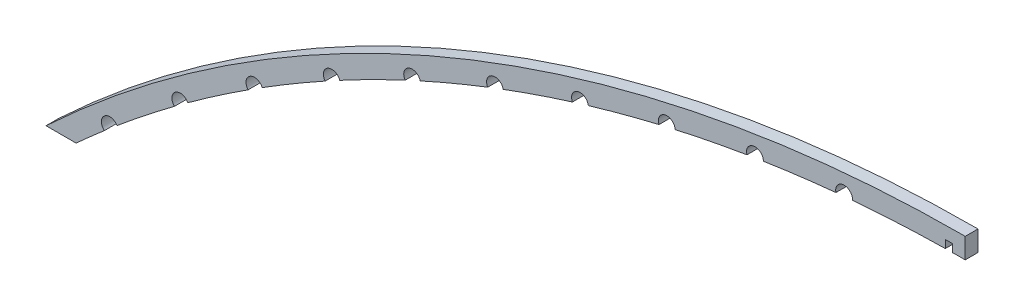
ISO-10303-21;
HEADER;
FILE_DESCRIPTION(('STEP AP214'),'2;1');
FILE_NAME('part.step','',(''),(''),'','','');
FILE_SCHEMA(('AUTOMOTIVE_DESIGN { 1 0 10303 214 1 1 1 1 }'));
ENDSEC;
DATA;
#1=APPLICATION_CONTEXT('core data for automotive mechanical design processes');
#2=APPLICATION_PROTOCOL_DEFINITION('international standard','automotive_design',2000,#1);
#3=PRODUCT_CONTEXT('',#1,'mechanical');
#4=PRODUCT('Part','Part','',(#3));
#5=PRODUCT_RELATED_PRODUCT_CATEGORY('part','',(#4));
#6=PRODUCT_DEFINITION_FORMATION('','',#4);
#7=PRODUCT_DEFINITION_CONTEXT('part definition',#1,'design');
#8=PRODUCT_DEFINITION('design','',#6,#7);
#9=PRODUCT_DEFINITION_SHAPE('','',#8);
#10=(LENGTH_UNIT() NAMED_UNIT(*) SI_UNIT(.MILLI.,.METRE.));
#11=(NAMED_UNIT(*) PLANE_ANGLE_UNIT() SI_UNIT($,.RADIAN.));
#12=(NAMED_UNIT(*) SI_UNIT($,.STERADIAN.) SOLID_ANGLE_UNIT());
#13=UNCERTAINTY_MEASURE_WITH_UNIT(LENGTH_MEASURE(1.E-05),#10,'distance_accuracy_value','');
#14=(GEOMETRIC_REPRESENTATION_CONTEXT(3) GLOBAL_UNCERTAINTY_ASSIGNED_CONTEXT((#13)) GLOBAL_UNIT_ASSIGNED_CONTEXT((#10,
#11,#12)) REPRESENTATION_CONTEXT('',''));
#15=CARTESIAN_POINT('',(0.,0.,0.));
#16=DIRECTION('',(0.,0.,1.));
#17=DIRECTION('',(1.,0.,0.));
#18=AXIS2_PLACEMENT_3D('',#15,#16,#17);
#19=CARTESIAN_POINT('',(228.6,-243.514144736841,310.522595060468));
#20=DIRECTION('',(0.,0.,-1.));
#21=DIRECTION('',(-1.,0.,0.));
#22=AXIS2_PLACEMENT_3D('',#19,#20,#21);
#23=CYLINDRICAL_SURFACE('',#22,328.921644736841);
#24=DIRECTION('',(0.,0.,-1.));
#25=VECTOR('',#24,1.);
#26=CARTESIAN_POINT('',(225.425,85.3921758947161,310.522595060468));
#27=LINE('',#26,#25);
#28=CARTESIAN_POINT('',(225.425,85.3921758947162,0.));
#29=VERTEX_POINT('',#28);
#30=CARTESIAN_POINT('',(225.425,85.3921758947162,3.17499999999998));
#31=VERTEX_POINT('',#30);
#32=EDGE_CURVE('E11',#29,#31,#27,.F.);
#33=ORIENTED_EDGE('',*,*,#32,.F.);
#34=CARTESIAN_POINT('',(228.6,-243.514144736841,0.));
#35=DIRECTION('',(0.,0.,-1.));
#36=DIRECTION('',(-1.,0.,0.));
#37=AXIS2_PLACEMENT_3D('',#34,#35,#36);
#38=CIRCLE('',#37,328.921644736841);
#39=CARTESIAN_POINT('',(228.6,85.4075000000001,0.));
#40=VERTEX_POINT('',#39);
#41=EDGE_CURVE('E238',#40,#29,#38,.F.);
#42=ORIENTED_EDGE('',*,*,#41,.F.);
#43=DIRECTION('',(0.,0.,-1.));
#44=VECTOR('',#43,1.);
#45=CARTESIAN_POINT('',(228.6,85.4075000000001,310.522595060468));
#46=LINE('',#45,#44);
#47=CARTESIAN_POINT('',(228.6,85.4075000000001,3.175));
#48=VERTEX_POINT('',#47);
#49=EDGE_CURVE('E254',#48,#40,#46,.T.);
#50=ORIENTED_EDGE('',*,*,#49,.F.);
#51=CARTESIAN_POINT('',(228.6,-243.514144736841,3.17499999999998));
#52=DIRECTION('',(0.,0.,-1.));
#53=DIRECTION('',(-1.,0.,0.));
#54=AXIS2_PLACEMENT_3D('',#51,#52,#53);
#55=CIRCLE('',#54,328.921644736841);
#56=EDGE_CURVE('E259',#48,#31,#55,.F.);
#57=ORIENTED_EDGE('',*,*,#56,.T.);
#58=EDGE_LOOP('',(#33,#42,#50,#57));
#59=FACE_BOUND('',#58,.T.);
#60=ADVANCED_FACE('F31',(#59),#23,.F.);
#61=CARTESIAN_POINT('',(14.5042082916886,6.19056156478265,3.175));
#62=VERTEX_POINT('',#61);
#63=CARTESIAN_POINT('',(7.48846776010612,0.,3.175));
#64=VERTEX_POINT('',#63);
#65=EDGE_CURVE('E251',#62,#64,#55,.F.);
#66=ORIENTED_EDGE('',*,*,#65,.T.);
#67=DIRECTION('',(0.,0.,-1.));
#68=VECTOR('',#67,1.);
#69=CARTESIAN_POINT('',(7.48846776010612,0.,310.522595060468));
#70=LINE('',#69,#68);
#71=CARTESIAN_POINT('',(7.48846776010612,0.,0.));
#72=VERTEX_POINT('',#71);
#73=EDGE_CURVE('E54',#64,#72,#70,.T.);
#74=ORIENTED_EDGE('',*,*,#73,.T.);
#75=CARTESIAN_POINT('',(14.5042082916886,6.19056156478265,0.));
#76=VERTEX_POINT('',#75);
#77=EDGE_CURVE('E241',#76,#72,#38,.F.);
#78=ORIENTED_EDGE('',*,*,#77,.F.);
#79=DIRECTION('',(0.,0.,-1.));
#80=VECTOR('',#79,1.);
#81=CARTESIAN_POINT('',(14.5042082916886,6.19056156478265,3.17500000000009));
#82=LINE('',#81,#80);
#83=EDGE_CURVE('E252',#76,#62,#82,.F.);
#84=ORIENTED_EDGE('',*,*,#83,.T.);
#85=EDGE_LOOP('',(#66,#74,#78,#84));
#86=FACE_BOUND('',#85,.T.);
#87=ADVANCED_FACE('F480',(#86),#23,.F.);
#88=CARTESIAN_POINT('',(228.6,-243.514144736841,3.175));
#89=DIRECTION('',(0.,0.,-1.));
#90=DIRECTION('',(-1.,0.,0.));
#91=AXIS2_PLACEMENT_3D('',#88,#89,#90);
#92=PLANE('',#91);
#93=CARTESIAN_POINT('',(223.647,85.3702060118511,3.17499999999998));
#94=VERTEX_POINT('',#93);
#95=CARTESIAN_POINT('',(200.570962712791,84.2110777364086,3.175));
#96=VERTEX_POINT('',#95);
#97=EDGE_CURVE('E244',#94,#96,#55,.F.);
#98=ORIENTED_EDGE('',*,*,#97,.F.);
#99=DIRECTION('',(0.,-1.,0.));
#100=VECTOR('',#99,1.);
#101=CARTESIAN_POINT('',(223.647,85.370206011851,3.175));
#102=LINE('',#101,#100);
#103=CARTESIAN_POINT('',(223.647,87.331989447736,3.175));
#104=VERTEX_POINT('',#103);
#105=EDGE_CURVE('E46',#104,#94,#102,.T.);
#106=ORIENTED_EDGE('',*,*,#105,.F.);
#107=DIRECTION('',(-1.,0.,0.));
#108=VECTOR('',#107,1.);
#109=CARTESIAN_POINT('',(223.647,87.331989447736,3.175));
#110=LINE('',#109,#108);
#111=CARTESIAN_POINT('',(225.425,87.331989447736,3.175));
#112=VERTEX_POINT('',#111);
#113=EDGE_CURVE('E233',#112,#104,#110,.T.);
#114=ORIENTED_EDGE('',*,*,#113,.F.);
#115=DIRECTION('',(0.,1.,0.));
#116=VECTOR('',#115,1.);
#117=CARTESIAN_POINT('',(225.425,85.370206011851,3.175));
#118=LINE('',#117,#116);
#119=EDGE_CURVE('E271',#31,#112,#118,.T.);
#120=ORIENTED_EDGE('',*,*,#119,.F.);
#121=ORIENTED_EDGE('',*,*,#56,.F.);
#122=DIRECTION('',(0.,1.,0.));
#123=VECTOR('',#122,1.);
#124=CARTESIAN_POINT('',(228.6,90.4875,3.175));
#125=LINE('',#124,#123);
#126=CARTESIAN_POINT('',(228.6,90.4875,3.175));
#127=VERTEX_POINT('',#126);
#128=EDGE_CURVE('E425',#48,#127,#125,.T.);
#129=ORIENTED_EDGE('',*,*,#128,.T.);
#130=CARTESIAN_POINT('',(228.6,-243.514144736841,3.175));
#131=DIRECTION('',(0.,0.,1.));
#132=DIRECTION('',(-1.,0.,0.));
#133=AXIS2_PLACEMENT_3D('',#130,#131,#132);
#134=CIRCLE('',#133,334.001644736841);
#135=CARTESIAN_POINT('',(0.,0.,3.175));
#136=VERTEX_POINT('',#135);
#137=EDGE_CURVE('E419',#127,#136,#134,.T.);
#138=ORIENTED_EDGE('',*,*,#137,.T.);
#139=DIRECTION('',(1.,0.,0.));
#140=VECTOR('',#139,1.);
#141=CARTESIAN_POINT('',(0.,0.,3.175));
#142=LINE('',#141,#140);
#143=EDGE_CURVE('E422',#136,#64,#142,.T.);
#144=ORIENTED_EDGE('',*,*,#143,.T.);
#145=ORIENTED_EDGE('',*,*,#65,.F.);
#146=CARTESIAN_POINT('',(15.875,7.77550646679812,3.175));
#147=DIRECTION('',(0.,0.,1.));
#148=DIRECTION('',(1.,0.,0.));
#149=AXIS2_PLACEMENT_3D('',#146,#147,#148);
#150=CIRCLE('',#149,2.0955);
#151=CARTESIAN_POINT('',(17.6644915981692,8.86584589563754,3.175));
#152=VERTEX_POINT('',#151);
#153=EDGE_CURVE('E412',#152,#62,#150,.T.);
#154=ORIENTED_EDGE('',*,*,#153,.F.);
#155=CARTESIAN_POINT('',(31.9326004568024,20.1359687342232,3.175));
#156=VERTEX_POINT('',#155);
#157=EDGE_CURVE('E348',#156,#152,#55,.F.);
#158=ORIENTED_EDGE('',*,*,#157,.F.);
#159=CARTESIAN_POINT('',(33.4077296853764,21.624294642419,3.175));
#160=DIRECTION('',(0.,0.,1.));
#161=DIRECTION('',(0.997697449972898,-0.0678218129924095,0.));
#162=AXIS2_PLACEMENT_3D('',#159,#160,#161);
#163=CIRCLE('',#162,2.0955);
#164=CARTESIAN_POINT('',(35.2670496864587,22.5907569456544,3.175));
#165=VERTEX_POINT('',#164);
#166=EDGE_CURVE('E407',#165,#156,#163,.T.);
#167=ORIENTED_EDGE('',*,*,#166,.F.);
#168=CARTESIAN_POINT('',(50.2666656742128,32.8672407518271,3.175));
#169=VERTEX_POINT('',#168);
#170=EDGE_CURVE('E338',#169,#165,#55,.F.);
#171=ORIENTED_EDGE('',*,*,#170,.F.);
#172=CARTESIAN_POINT('',(51.839339305359,34.2520937764826,3.175));
#173=DIRECTION('',(0.,0.,1.));
#174=DIRECTION('',(0.990800403364845,-0.135331299750131,0.));
#175=AXIS2_PLACEMENT_3D('',#172,#173,#174);
#176=CIRCLE('',#175,2.0955);
#177=CARTESIAN_POINT('',(53.7599253547167,35.0902282985091,3.175));
#178=VERTEX_POINT('',#177);
#179=EDGE_CURVE('E402',#178,#169,#176,.T.);
#180=ORIENTED_EDGE('',*,*,#179,.F.);
#181=CARTESIAN_POINT('',(69.4219737391934,44.325748836136,3.175));
#182=VERTEX_POINT('',#181);
#183=EDGE_CURVE('E328',#182,#178,#55,.F.);
#184=ORIENTED_EDGE('',*,*,#183,.F.);
#185=CARTESIAN_POINT('',(71.0849494534877,45.6007515905124,3.175));
#186=DIRECTION('',(0.,0.,1.));
#187=DIRECTION('',(0.979340621765552,-0.202217572332038,0.));
#188=AXIS2_PLACEMENT_3D('',#185,#186,#187);
#189=CIRCLE('',#188,2.0955);
#190=CARTESIAN_POINT('',(73.0579570602008,46.3066986379971,3.175));
#191=VERTEX_POINT('',#190);
#192=EDGE_CURVE('E397',#191,#182,#189,.T.);
#193=ORIENTED_EDGE('',*,*,#192,.F.);
#194=CARTESIAN_POINT('',(89.3103125415358,54.4587254109496,3.175));
#195=VERTEX_POINT('',#194);
#196=EDGE_CURVE('E318',#195,#191,#55,.F.);
#197=ORIENTED_EDGE('',*,*,#196,.F.);
#198=CARTESIAN_POINT('',(91.0559321694262,55.6180063797936,3.175));
#199=DIRECTION('',(0.,0.,1.));
#200=DIRECTION('',(0.96337087861588,-0.268172612760638,0.));
#201=AXIS2_PLACEMENT_3D('',#198,#199,#200);
#202=CIRCLE('',#201,2.0955);
#203=CARTESIAN_POINT('',(93.0722754360581,56.1885149959499,3.175));
#204=VERTEX_POINT('',#203);
#205=EDGE_CURVE('E392',#204,#195,#202,.T.);
#206=ORIENTED_EDGE('',*,*,#205,.F.);
#207=CARTESIAN_POINT('',(109.840094291143,63.2195071052942,3.175));
#208=VERTEX_POINT('',#207);
#209=EDGE_CURVE('E308',#208,#204,#55,.F.);
#210=ORIENTED_EDGE('',*,*,#209,.F.);
#211=CARTESIAN_POINT('',(111.660319079587,64.2577276837532,3.175));
#212=DIRECTION('',(0.,0.,1.));
#213=DIRECTION('',(0.942964716180876,-0.332892691475677,0.));
#214=AXIS2_PLACEMENT_3D('',#211,#212,#213);
#215=CIRCLE('',#214,2.0955);
#216=CARTESIAN_POINT('',(113.710712543651,64.690170619322,3.175));
#217=VERTEX_POINT('',#216);
#218=EDGE_CURVE('E387',#217,#208,#215,.T.);
#219=ORIENTED_EDGE('',*,*,#218,.F.);
#220=CARTESIAN_POINT('',(130.916777288968,70.5677496429142,3.175));
#221=VERTEX_POINT('',#220);
#222=EDGE_CURVE('E298',#221,#217,#55,.F.);
#223=ORIENTED_EDGE('',*,*,#222,.F.);
#224=CARTESIAN_POINT('',(132.803224920693,71.4801287213462,3.175));
#225=DIRECTION('',(0.,0.,1.));
#226=DIRECTION('',(0.918216106880274,-0.396079766039158,0.));
#227=AXIS2_PLACEMENT_3D('',#224,#225,#226);
#228=CIRCLE('',#227,2.0955);
#229=CARTESIAN_POINT('',(134.878226315137,71.7725145333413,3.175));
#230=VERTEX_POINT('',#229);
#231=EDGE_CURVE('E382',#230,#221,#228,.T.);
#232=ORIENTED_EDGE('',*,*,#231,.F.);
#233=CARTESIAN_POINT('',(152.443301300994,76.4696136317012,3.175));
#234=VERTEX_POINT('',#233);
#235=EDGE_CURVE('E289',#234,#230,#55,.F.);
#236=ORIENTED_EDGE('',*,*,#235,.F.);
#237=CARTESIAN_POINT('',(154.387284495909,77.2519496131627,3.175));
#238=DIRECTION('',(0.,0.,1.));
#239=DIRECTION('',(0.889239020536106,-0.457442853650582,0.));
#240=AXIS2_PLACEMENT_3D('',#237,#238,#239);
#241=CIRCLE('',#240,2.0955);
#242=CARTESIAN_POINT('',(156.477338231699,77.4029318356654,3.175));
#243=VERTEX_POINT('',#242);
#244=EDGE_CURVE('E377',#243,#234,#241,.T.);
#245=ORIENTED_EDGE('',*,*,#244,.F.);
#246=CARTESIAN_POINT('',(174.320534530327,80.8979203974807,3.175));
#247=VERTEX_POINT('',#246);
#248=EDGE_CURVE('E284',#247,#243,#55,.F.);
#249=ORIENTED_EDGE('',*,*,#248,.F.);
#250=CARTESIAN_POINT('',(176.313101051316,81.5466105465008,3.175));
#251=DIRECTION('',(0.,0.,1.));
#252=DIRECTION('',(0.856166899530266,-0.516699371151864,0.));
#253=AXIS2_PLACEMENT_3D('',#250,#251,#252);
#254=CIRCLE('',#253,2.0955);
#255=CARTESIAN_POINT('',(178.408582221879,81.5554938912703,3.175));
#256=VERTEX_POINT('',#255);
#257=EDGE_CURVE('E373',#256,#247,#254,.T.);
#258=ORIENTED_EDGE('',*,*,#257,.F.);
#259=CARTESIAN_POINT('',(196.447730129037,83.8322771445254,3.175));
#260=VERTEX_POINT('',#259);
#261=EDGE_CURVE('E247',#260,#256,#55,.F.);
#262=ORIENTED_EDGE('',*,*,#261,.F.);
#263=CARTESIAN_POINT('',(198.479704007906,84.344334178064,3.175));
#264=DIRECTION('',(0.,0.,1.));
#265=DIRECTION('',(0.819152044288991,-0.573576436351047,0.));
#266=AXIS2_PLACEMENT_3D('',#263,#264,#265);
#267=CIRCLE('',#266,2.0955);
#268=EDGE_CURVE('E366',#96,#260,#267,.T.);
#269=ORIENTED_EDGE('',*,*,#268,.F.);
#270=EDGE_LOOP('',(#98,#106,#114,#120,#121,#129,#138,#144,#145,#154,#158,#167,#171,#180,#184,
#193,#197,#206,#210,#219,#223,#232,#236,#245,#249,#258,#262,#269));
#271=FACE_BOUND('',#270,.T.);
#272=ADVANCED_FACE('F447',(#271),#92,.F.);
#273=CARTESIAN_POINT('',(228.6,-243.514144736841,0.));
#274=DIRECTION('',(0.,0.,-1.));
#275=DIRECTION('',(-1.,0.,0.));
#276=AXIS2_PLACEMENT_3D('',#273,#274,#275);
#277=PLANE('',#276);
#278=DIRECTION('',(0.,-1.,0.));
#279=VECTOR('',#278,1.);
#280=CARTESIAN_POINT('',(223.647,85.370206011851,0.));
#281=LINE('',#280,#279);
#282=CARTESIAN_POINT('',(223.647,87.331989447736,0.));
#283=VERTEX_POINT('',#282);
#284=CARTESIAN_POINT('',(223.647,85.370206011851,0.));
#285=VERTEX_POINT('',#284);
#286=EDGE_CURVE('E217',#283,#285,#281,.T.);
#287=ORIENTED_EDGE('',*,*,#286,.T.);
#288=CARTESIAN_POINT('',(200.570962712791,84.2110777364086,0.));
#289=VERTEX_POINT('',#288);
#290=EDGE_CURVE('E228',#285,#289,#38,.F.);
#291=ORIENTED_EDGE('',*,*,#290,.T.);
#292=CARTESIAN_POINT('',(198.479704007906,84.344334178064,0.));
#293=DIRECTION('',(0.,0.,1.));
#294=DIRECTION('',(0.819152044288991,-0.573576436351047,0.));
#295=AXIS2_PLACEMENT_3D('',#292,#293,#294);
#296=CIRCLE('',#295,2.0955);
#297=CARTESIAN_POINT('',(196.447730129037,83.8322771445254,0.));
#298=VERTEX_POINT('',#297);
#299=EDGE_CURVE('E369',#289,#298,#296,.T.);
#300=ORIENTED_EDGE('',*,*,#299,.T.);
#301=CARTESIAN_POINT('',(178.408582221879,81.5554938912703,0.));
#302=VERTEX_POINT('',#301);
#303=EDGE_CURVE('E242',#298,#302,#38,.F.);
#304=ORIENTED_EDGE('',*,*,#303,.T.);
#305=CARTESIAN_POINT('',(176.313101051316,81.5466105465008,0.));
#306=DIRECTION('',(0.,0.,1.));
#307=DIRECTION('',(0.856166899530266,-0.516699371151864,0.));
#308=AXIS2_PLACEMENT_3D('',#305,#306,#307);
#309=CIRCLE('',#308,2.0955);
#310=CARTESIAN_POINT('',(174.320534530327,80.8979203974807,0.));
#311=VERTEX_POINT('',#310);
#312=EDGE_CURVE('E375',#302,#311,#309,.T.);
#313=ORIENTED_EDGE('',*,*,#312,.T.);
#314=CARTESIAN_POINT('',(156.477338231699,77.4029318356654,0.));
#315=VERTEX_POINT('',#314);
#316=EDGE_CURVE('E245',#311,#315,#38,.F.);
#317=ORIENTED_EDGE('',*,*,#316,.T.);
#318=CARTESIAN_POINT('',(154.387284495909,77.2519496131627,0.));
#319=DIRECTION('',(0.,0.,1.));
#320=DIRECTION('',(0.889239020536106,-0.457442853650582,0.));
#321=AXIS2_PLACEMENT_3D('',#318,#319,#320);
#322=CIRCLE('',#321,2.0955);
#323=CARTESIAN_POINT('',(152.443301300994,76.4696136317012,0.));
#324=VERTEX_POINT('',#323);
#325=EDGE_CURVE('E379',#315,#324,#322,.T.);
#326=ORIENTED_EDGE('',*,*,#325,.T.);
#327=CARTESIAN_POINT('',(134.878226315137,71.7725145333413,0.));
#328=VERTEX_POINT('',#327);
#329=EDGE_CURVE('E295',#324,#328,#38,.F.);
#330=ORIENTED_EDGE('',*,*,#329,.T.);
#331=CARTESIAN_POINT('',(132.803224920693,71.4801287213462,0.));
#332=DIRECTION('',(0.,0.,1.));
#333=DIRECTION('',(0.918216106880274,-0.396079766039158,0.));
#334=AXIS2_PLACEMENT_3D('',#331,#332,#333);
#335=CIRCLE('',#334,2.0955);
#336=CARTESIAN_POINT('',(130.916777288968,70.5677496429142,0.));
#337=VERTEX_POINT('',#336);
#338=EDGE_CURVE('E384',#328,#337,#335,.T.);
#339=ORIENTED_EDGE('',*,*,#338,.T.);
#340=CARTESIAN_POINT('',(113.710712543651,64.690170619322,0.));
#341=VERTEX_POINT('',#340);
#342=EDGE_CURVE('E305',#337,#341,#38,.F.);
#343=ORIENTED_EDGE('',*,*,#342,.T.);
#344=CARTESIAN_POINT('',(111.660319079587,64.2577276837532,0.));
#345=DIRECTION('',(0.,0.,1.));
#346=DIRECTION('',(0.942964716180876,-0.332892691475677,0.));
#347=AXIS2_PLACEMENT_3D('',#344,#345,#346);
#348=CIRCLE('',#347,2.0955);
#349=CARTESIAN_POINT('',(109.840094291143,63.2195071052942,0.));
#350=VERTEX_POINT('',#349);
#351=EDGE_CURVE('E389',#341,#350,#348,.T.);
#352=ORIENTED_EDGE('',*,*,#351,.T.);
#353=CARTESIAN_POINT('',(93.0722754360581,56.1885149959499,0.));
#354=VERTEX_POINT('',#353);
#355=EDGE_CURVE('E315',#350,#354,#38,.F.);
#356=ORIENTED_EDGE('',*,*,#355,.T.);
#357=CARTESIAN_POINT('',(91.0559321694262,55.6180063797936,0.));
#358=DIRECTION('',(0.,0.,1.));
#359=DIRECTION('',(0.96337087861588,-0.268172612760638,0.));
#360=AXIS2_PLACEMENT_3D('',#357,#358,#359);
#361=CIRCLE('',#360,2.0955);
#362=CARTESIAN_POINT('',(89.3103125415358,54.4587254109496,0.));
#363=VERTEX_POINT('',#362);
#364=EDGE_CURVE('E394',#354,#363,#361,.T.);
#365=ORIENTED_EDGE('',*,*,#364,.T.);
#366=CARTESIAN_POINT('',(73.0579570602008,46.3066986379971,0.));
#367=VERTEX_POINT('',#366);
#368=EDGE_CURVE('E325',#363,#367,#38,.F.);
#369=ORIENTED_EDGE('',*,*,#368,.T.);
#370=CARTESIAN_POINT('',(71.0849494534877,45.6007515905124,0.));
#371=DIRECTION('',(0.,0.,1.));
#372=DIRECTION('',(0.979340621765552,-0.202217572332038,0.));
#373=AXIS2_PLACEMENT_3D('',#370,#371,#372);
#374=CIRCLE('',#373,2.0955);
#375=CARTESIAN_POINT('',(69.4219737391934,44.325748836136,0.));
#376=VERTEX_POINT('',#375);
#377=EDGE_CURVE('E399',#367,#376,#374,.T.);
#378=ORIENTED_EDGE('',*,*,#377,.T.);
#379=CARTESIAN_POINT('',(53.7599253547167,35.0902282985091,0.));
#380=VERTEX_POINT('',#379);
#381=EDGE_CURVE('E335',#376,#380,#38,.F.);
#382=ORIENTED_EDGE('',*,*,#381,.T.);
#383=CARTESIAN_POINT('',(51.839339305359,34.2520937764826,0.));
#384=DIRECTION('',(0.,0.,1.));
#385=DIRECTION('',(0.990800403364845,-0.135331299750131,0.));
#386=AXIS2_PLACEMENT_3D('',#383,#384,#385);
#387=CIRCLE('',#386,2.0955);
#388=CARTESIAN_POINT('',(50.2666656742128,32.8672407518271,0.));
#389=VERTEX_POINT('',#388);
#390=EDGE_CURVE('E404',#380,#389,#387,.T.);
#391=ORIENTED_EDGE('',*,*,#390,.T.);
#392=CARTESIAN_POINT('',(35.2670496864587,22.5907569456544,0.));
#393=VERTEX_POINT('',#392);
#394=EDGE_CURVE('E345',#389,#393,#38,.F.);
#395=ORIENTED_EDGE('',*,*,#394,.T.);
#396=CARTESIAN_POINT('',(33.4077296853764,21.624294642419,0.));
#397=DIRECTION('',(0.,0.,1.));
#398=DIRECTION('',(0.997697449972898,-0.0678218129924095,0.));
#399=AXIS2_PLACEMENT_3D('',#396,#397,#398);
#400=CIRCLE('',#399,2.0955);
#401=CARTESIAN_POINT('',(31.9326004568024,20.1359687342232,0.));
#402=VERTEX_POINT('',#401);
#403=EDGE_CURVE('E409',#393,#402,#400,.T.);
#404=ORIENTED_EDGE('',*,*,#403,.T.);
#405=CARTESIAN_POINT('',(17.6644915981692,8.86584589563754,0.));
#406=VERTEX_POINT('',#405);
#407=EDGE_CURVE('E253',#402,#406,#38,.F.);
#408=ORIENTED_EDGE('',*,*,#407,.T.);
#409=CARTESIAN_POINT('',(15.875,7.77550646679812,0.));
#410=DIRECTION('',(0.,0.,1.));
#411=DIRECTION('',(1.,0.,0.));
#412=AXIS2_PLACEMENT_3D('',#409,#410,#411);
#413=CIRCLE('',#412,2.0955);
#414=EDGE_CURVE('E414',#406,#76,#413,.T.);
#415=ORIENTED_EDGE('',*,*,#414,.T.);
#416=ORIENTED_EDGE('',*,*,#77,.T.);
#417=DIRECTION('',(1.,0.,0.));
#418=VECTOR('',#417,1.);
#419=CARTESIAN_POINT('',(0.,0.,0.));
#420=LINE('',#419,#418);
#421=CARTESIAN_POINT('',(0.,0.,0.));
#422=VERTEX_POINT('',#421);
#423=EDGE_CURVE('E430',#422,#72,#420,.T.);
#424=ORIENTED_EDGE('',*,*,#423,.F.);
#425=CARTESIAN_POINT('',(228.6,-243.514144736841,0.));
#426=DIRECTION('',(0.,0.,1.));
#427=DIRECTION('',(-1.,0.,0.));
#428=AXIS2_PLACEMENT_3D('',#425,#426,#427);
#429=CIRCLE('',#428,334.001644736841);
#430=CARTESIAN_POINT('',(228.6,90.4875,0.));
#431=VERTEX_POINT('',#430);
#432=EDGE_CURVE('E417',#431,#422,#429,.T.);
#433=ORIENTED_EDGE('',*,*,#432,.F.);
#434=DIRECTION('',(0.,1.,0.));
#435=VECTOR('',#434,1.);
#436=CARTESIAN_POINT('',(228.6,90.4875,0.));
#437=LINE('',#436,#435);
#438=EDGE_CURVE('E423',#40,#431,#437,.T.);
#439=ORIENTED_EDGE('',*,*,#438,.F.);
#440=ORIENTED_EDGE('',*,*,#41,.T.);
#441=DIRECTION('',(0.,1.,0.));
#442=VECTOR('',#441,1.);
#443=CARTESIAN_POINT('',(225.425,85.370206011851,0.));
#444=LINE('',#443,#442);
#445=CARTESIAN_POINT('',(225.425,87.331989447736,0.));
#446=VERTEX_POINT('',#445);
#447=EDGE_CURVE('E232',#29,#446,#444,.T.);
#448=ORIENTED_EDGE('',*,*,#447,.T.);
#449=DIRECTION('',(-1.,0.,0.));
#450=VECTOR('',#449,1.);
#451=CARTESIAN_POINT('',(223.647,87.331989447736,0.));
#452=LINE('',#451,#450);
#453=EDGE_CURVE('E223',#446,#283,#452,.T.);
#454=ORIENTED_EDGE('',*,*,#453,.T.);
#455=EDGE_LOOP('',(#287,#291,#300,#304,#313,#317,#326,#330,#339,#343,#352,#356,#365,#369,#378,
#382,#391,#395,#404,#408,#415,#416,#424,#433,#439,#440,#448,#454));
#456=FACE_BOUND('',#455,.T.);
#457=ADVANCED_FACE('F226',(#456),#277,.T.);
#458=CARTESIAN_POINT('',(0.,0.,3.175));
#459=DIRECTION('',(0.,1.,0.));
#460=DIRECTION('',(0.,0.,1.));
#461=AXIS2_PLACEMENT_3D('',#458,#459,#460);
#462=PLANE('',#461);
#463=ORIENTED_EDGE('',*,*,#73,.F.);
#464=ORIENTED_EDGE('',*,*,#143,.F.);
#465=DIRECTION('',(0.,0.,-1.));
#466=VECTOR('',#465,1.);
#467=CARTESIAN_POINT('',(0.,0.,3.175));
#468=LINE('',#467,#466);
#469=EDGE_CURVE('E435',#136,#422,#468,.T.);
#470=ORIENTED_EDGE('',*,*,#469,.T.);
#471=ORIENTED_EDGE('',*,*,#423,.T.);
#472=EDGE_LOOP('',(#463,#464,#470,#471));
#473=FACE_BOUND('',#472,.T.);
#474=ADVANCED_FACE('F509',(#473),#462,.F.);
#475=CARTESIAN_POINT('',(228.6,90.4875,3.175));
#476=DIRECTION('',(-1.,0.,0.));
#477=DIRECTION('',(0.,0.,1.));
#478=AXIS2_PLACEMENT_3D('',#475,#476,#477);
#479=PLANE('',#478);
#480=ORIENTED_EDGE('',*,*,#49,.T.);
#481=ORIENTED_EDGE('',*,*,#438,.T.);
#482=DIRECTION('',(0.,0.,-1.));
#483=VECTOR('',#482,1.);
#484=CARTESIAN_POINT('',(228.6,90.4875,3.175));
#485=LINE('',#484,#483);
#486=EDGE_CURVE('E427',#127,#431,#485,.T.);
#487=ORIENTED_EDGE('',*,*,#486,.F.);
#488=ORIENTED_EDGE('',*,*,#128,.F.);
#489=EDGE_LOOP('',(#480,#481,#487,#488));
#490=FACE_BOUND('',#489,.T.);
#491=ADVANCED_FACE('F510',(#490),#479,.F.);
#492=CARTESIAN_POINT('',(15.875,7.77550646679812,0.));
#493=DIRECTION('',(0.,0.,1.));
#494=DIRECTION('',(1.,0.,0.));
#495=AXIS2_PLACEMENT_3D('',#492,#493,#494);
#496=CYLINDRICAL_SURFACE('',#495,2.0955);
#497=DIRECTION('',(0.,0.,-1.));
#498=VECTOR('',#497,1.);
#499=CARTESIAN_POINT('',(17.6644915981692,8.86584589563755,3.17500000000009));
#500=LINE('',#499,#498);
#501=EDGE_CURVE('E356',#152,#406,#500,.T.);
#502=ORIENTED_EDGE('',*,*,#501,.F.);
#503=ORIENTED_EDGE('',*,*,#153,.T.);
#504=ORIENTED_EDGE('',*,*,#83,.F.);
#505=ORIENTED_EDGE('',*,*,#414,.F.);
#506=EDGE_LOOP('',(#502,#503,#504,#505));
#507=FACE_BOUND('',#506,.T.);
#508=ADVANCED_FACE('F479',(#507),#496,.F.);
#509=CARTESIAN_POINT('',(33.4077296853764,21.624294642419,0.));
#510=DIRECTION('',(0.,0.,1.));
#511=DIRECTION('',(1.,0.,0.));
#512=AXIS2_PLACEMENT_3D('',#509,#510,#511);
#513=CYLINDRICAL_SURFACE('',#512,2.0955);
#514=DIRECTION('',(0.,0.,-1.));
#515=VECTOR('',#514,1.);
#516=CARTESIAN_POINT('',(35.2670496864587,22.5907569456544,3.17500000000009));
#517=LINE('',#516,#515);
#518=EDGE_CURVE('E347',#165,#393,#517,.T.);
#519=ORIENTED_EDGE('',*,*,#518,.F.);
#520=ORIENTED_EDGE('',*,*,#166,.T.);
#521=DIRECTION('',(0.,0.,-1.));
#522=VECTOR('',#521,1.);
#523=CARTESIAN_POINT('',(31.9326004568024,20.1359687342232,3.17500000000009));
#524=LINE('',#523,#522);
#525=EDGE_CURVE('E353',#402,#156,#524,.F.);
#526=ORIENTED_EDGE('',*,*,#525,.F.);
#527=ORIENTED_EDGE('',*,*,#403,.F.);
#528=EDGE_LOOP('',(#519,#520,#526,#527));
#529=FACE_BOUND('',#528,.T.);
#530=ADVANCED_FACE('F470',(#529),#513,.F.);
#531=CARTESIAN_POINT('',(51.839339305359,34.2520937764826,0.));
#532=DIRECTION('',(0.,0.,1.));
#533=DIRECTION('',(1.,0.,0.));
#534=AXIS2_PLACEMENT_3D('',#531,#532,#533);
#535=CYLINDRICAL_SURFACE('',#534,2.0955);
#536=DIRECTION('',(0.,0.,-1.));
#537=VECTOR('',#536,1.);
#538=CARTESIAN_POINT('',(53.7599253547167,35.0902282985091,3.17500000000009));
#539=LINE('',#538,#537);
#540=EDGE_CURVE('E337',#178,#380,#539,.T.);
#541=ORIENTED_EDGE('',*,*,#540,.F.);
#542=ORIENTED_EDGE('',*,*,#179,.T.);
#543=DIRECTION('',(0.,0.,-1.));
#544=VECTOR('',#543,1.);
#545=CARTESIAN_POINT('',(50.2666656742128,32.8672407518271,3.17500000000009));
#546=LINE('',#545,#544);
#547=EDGE_CURVE('E343',#389,#169,#546,.F.);
#548=ORIENTED_EDGE('',*,*,#547,.F.);
#549=ORIENTED_EDGE('',*,*,#390,.F.);
#550=EDGE_LOOP('',(#541,#542,#548,#549));
#551=FACE_BOUND('',#550,.T.);
#552=ADVANCED_FACE('F523',(#551),#535,.F.);
#553=CARTESIAN_POINT('',(71.0849494534877,45.6007515905124,0.));
#554=DIRECTION('',(0.,0.,1.));
#555=DIRECTION('',(1.,0.,0.));
#556=AXIS2_PLACEMENT_3D('',#553,#554,#555);
#557=CYLINDRICAL_SURFACE('',#556,2.0955);
#558=DIRECTION('',(0.,0.,-1.));
#559=VECTOR('',#558,1.);
#560=CARTESIAN_POINT('',(73.0579570602008,46.3066986379971,3.17500000000009));
#561=LINE('',#560,#559);
#562=EDGE_CURVE('E327',#191,#367,#561,.T.);
#563=ORIENTED_EDGE('',*,*,#562,.F.);
#564=ORIENTED_EDGE('',*,*,#192,.T.);
#565=DIRECTION('',(0.,0.,-1.));
#566=VECTOR('',#565,1.);
#567=CARTESIAN_POINT('',(69.4219737391934,44.325748836136,3.17500000000009));
#568=LINE('',#567,#566);
#569=EDGE_CURVE('E333',#376,#182,#568,.F.);
#570=ORIENTED_EDGE('',*,*,#569,.F.);
#571=ORIENTED_EDGE('',*,*,#377,.F.);
#572=EDGE_LOOP('',(#563,#564,#570,#571));
#573=FACE_BOUND('',#572,.T.);
#574=ADVANCED_FACE('F526',(#573),#557,.F.);
#575=CARTESIAN_POINT('',(91.0559321694262,55.6180063797936,0.));
#576=DIRECTION('',(0.,0.,1.));
#577=DIRECTION('',(1.,0.,0.));
#578=AXIS2_PLACEMENT_3D('',#575,#576,#577);
#579=CYLINDRICAL_SURFACE('',#578,2.0955);
#580=DIRECTION('',(0.,0.,-1.));
#581=VECTOR('',#580,1.);
#582=CARTESIAN_POINT('',(93.072275436058,56.1885149959498,3.17500000000009));
#583=LINE('',#582,#581);
#584=EDGE_CURVE('E317',#204,#354,#583,.T.);
#585=ORIENTED_EDGE('',*,*,#584,.F.);
#586=ORIENTED_EDGE('',*,*,#205,.T.);
#587=DIRECTION('',(0.,0.,-1.));
#588=VECTOR('',#587,1.);
#589=CARTESIAN_POINT('',(89.3103125415359,54.4587254109496,3.17500000000009));
#590=LINE('',#589,#588);
#591=EDGE_CURVE('E323',#363,#195,#590,.F.);
#592=ORIENTED_EDGE('',*,*,#591,.F.);
#593=ORIENTED_EDGE('',*,*,#364,.F.);
#594=EDGE_LOOP('',(#585,#586,#592,#593));
#595=FACE_BOUND('',#594,.T.);
#596=ADVANCED_FACE('F530',(#595),#579,.F.);
#597=CARTESIAN_POINT('',(111.660319079587,64.2577276837532,0.));
#598=DIRECTION('',(0.,0.,1.));
#599=DIRECTION('',(1.,0.,0.));
#600=AXIS2_PLACEMENT_3D('',#597,#598,#599);
#601=CYLINDRICAL_SURFACE('',#600,2.0955);
#602=DIRECTION('',(0.,0.,-1.));
#603=VECTOR('',#602,1.);
#604=CARTESIAN_POINT('',(113.710712543651,64.690170619322,3.17500000000009));
#605=LINE('',#604,#603);
#606=EDGE_CURVE('E307',#217,#341,#605,.T.);
#607=ORIENTED_EDGE('',*,*,#606,.F.);
#608=ORIENTED_EDGE('',*,*,#218,.T.);
#609=DIRECTION('',(0.,0.,-1.));
#610=VECTOR('',#609,1.);
#611=CARTESIAN_POINT('',(109.840094291143,63.2195071052942,3.17500000000009));
#612=LINE('',#611,#610);
#613=EDGE_CURVE('E313',#350,#208,#612,.F.);
#614=ORIENTED_EDGE('',*,*,#613,.F.);
#615=ORIENTED_EDGE('',*,*,#351,.F.);
#616=EDGE_LOOP('',(#607,#608,#614,#615));
#617=FACE_BOUND('',#616,.T.);
#618=ADVANCED_FACE('F534',(#617),#601,.F.);
#619=CARTESIAN_POINT('',(132.803224920693,71.4801287213462,0.));
#620=DIRECTION('',(0.,0.,1.));
#621=DIRECTION('',(1.,0.,0.));
#622=AXIS2_PLACEMENT_3D('',#619,#620,#621);
#623=CYLINDRICAL_SURFACE('',#622,2.0955);
#624=DIRECTION('',(0.,0.,-1.));
#625=VECTOR('',#624,1.);
#626=CARTESIAN_POINT('',(134.878226315137,71.7725145333413,3.17500000000009));
#627=LINE('',#626,#625);
#628=EDGE_CURVE('E297',#230,#328,#627,.T.);
#629=ORIENTED_EDGE('',*,*,#628,.F.);
#630=ORIENTED_EDGE('',*,*,#231,.T.);
#631=DIRECTION('',(0.,0.,-1.));
#632=VECTOR('',#631,1.);
#633=CARTESIAN_POINT('',(130.916777288968,70.5677496429142,3.17500000000009));
#634=LINE('',#633,#632);
#635=EDGE_CURVE('E303',#337,#221,#634,.F.);
#636=ORIENTED_EDGE('',*,*,#635,.F.);
#637=ORIENTED_EDGE('',*,*,#338,.F.);
#638=EDGE_LOOP('',(#629,#630,#636,#637));
#639=FACE_BOUND('',#638,.T.);
#640=ADVANCED_FACE('F538',(#639),#623,.F.);
#641=CARTESIAN_POINT('',(154.387284495909,77.2519496131627,0.));
#642=DIRECTION('',(0.,0.,1.));
#643=DIRECTION('',(1.,0.,0.));
#644=AXIS2_PLACEMENT_3D('',#641,#642,#643);
#645=CYLINDRICAL_SURFACE('',#644,2.0955);
#646=DIRECTION('',(0.,0.,-1.));
#647=VECTOR('',#646,1.);
#648=CARTESIAN_POINT('',(156.477338231699,77.4029318356654,3.17500000000009));
#649=LINE('',#648,#647);
#650=EDGE_CURVE('E288',#243,#315,#649,.T.);
#651=ORIENTED_EDGE('',*,*,#650,.F.);
#652=ORIENTED_EDGE('',*,*,#244,.T.);
#653=DIRECTION('',(0.,0.,-1.));
#654=VECTOR('',#653,1.);
#655=CARTESIAN_POINT('',(152.443301300994,76.4696136317012,3.17500000000009));
#656=LINE('',#655,#654);
#657=EDGE_CURVE('E293',#324,#234,#656,.F.);
#658=ORIENTED_EDGE('',*,*,#657,.F.);
#659=ORIENTED_EDGE('',*,*,#325,.F.);
#660=EDGE_LOOP('',(#651,#652,#658,#659));
#661=FACE_BOUND('',#660,.T.);
#662=ADVANCED_FACE('F455',(#661),#645,.F.);
#663=CARTESIAN_POINT('',(176.313101051316,81.5466105465008,0.));
#664=DIRECTION('',(0.,0.,1.));
#665=DIRECTION('',(1.,0.,0.));
#666=AXIS2_PLACEMENT_3D('',#663,#664,#665);
#667=CYLINDRICAL_SURFACE('',#666,2.0955);
#668=DIRECTION('',(0.,0.,-1.));
#669=VECTOR('',#668,1.);
#670=CARTESIAN_POINT('',(178.408582221879,81.5554938912703,3.17500000000009));
#671=LINE('',#670,#669);
#672=EDGE_CURVE('E239',#256,#302,#671,.T.);
#673=ORIENTED_EDGE('',*,*,#672,.F.);
#674=ORIENTED_EDGE('',*,*,#257,.T.);
#675=DIRECTION('',(0.,0.,-1.));
#676=VECTOR('',#675,1.);
#677=CARTESIAN_POINT('',(174.320534530328,80.8979203974807,3.17500000000009));
#678=LINE('',#677,#676);
#679=EDGE_CURVE('E283',#311,#247,#678,.F.);
#680=ORIENTED_EDGE('',*,*,#679,.F.);
#681=ORIENTED_EDGE('',*,*,#312,.F.);
#682=EDGE_LOOP('',(#673,#674,#680,#681));
#683=FACE_BOUND('',#682,.T.);
#684=ADVANCED_FACE('F450',(#683),#667,.F.);
#685=CARTESIAN_POINT('',(198.479704007906,84.344334178064,0.));
#686=DIRECTION('',(0.,0.,1.));
#687=DIRECTION('',(1.,0.,0.));
#688=AXIS2_PLACEMENT_3D('',#685,#686,#687);
#689=CYLINDRICAL_SURFACE('',#688,2.0955);
#690=DIRECTION('',(0.,0.,-1.));
#691=VECTOR('',#690,1.);
#692=CARTESIAN_POINT('',(200.570962712791,84.2110777364086,3.17500000000009));
#693=LINE('',#692,#691);
#694=EDGE_CURVE('E39',#96,#289,#693,.T.);
#695=ORIENTED_EDGE('',*,*,#694,.F.);
#696=ORIENTED_EDGE('',*,*,#268,.T.);
#697=DIRECTION('',(0.,0.,-1.));
#698=VECTOR('',#697,1.);
#699=CARTESIAN_POINT('',(196.447730129037,83.8322771445254,3.17500000000009));
#700=LINE('',#699,#698);
#701=EDGE_CURVE('E438',#298,#260,#700,.F.);
#702=ORIENTED_EDGE('',*,*,#701,.F.);
#703=ORIENTED_EDGE('',*,*,#299,.F.);
#704=EDGE_LOOP('',(#695,#696,#702,#703));
#705=FACE_BOUND('',#704,.T.);
#706=ADVANCED_FACE('F444',(#705),#689,.F.);
#707=CARTESIAN_POINT('',(228.6,-243.514144736841,3.175));
#708=DIRECTION('',(0.,0.,-1.));
#709=DIRECTION('',(-1.,0.,0.));
#710=AXIS2_PLACEMENT_3D('',#707,#708,#709);
#711=CYLINDRICAL_SURFACE('',#710,334.001644736841);
#712=ORIENTED_EDGE('',*,*,#432,.T.);
#713=ORIENTED_EDGE('',*,*,#469,.F.);
#714=ORIENTED_EDGE('',*,*,#137,.F.);
#715=ORIENTED_EDGE('',*,*,#486,.T.);
#716=EDGE_LOOP('',(#712,#713,#714,#715));
#717=FACE_BOUND('',#716,.T.);
#718=ADVANCED_FACE('F33',(#717),#711,.T.);
#719=DIRECTION('',(0.,0.,1.));
#720=VECTOR('',#719,1.);
#721=CARTESIAN_POINT('',(223.647,85.370206011851,0.));
#722=LINE('',#721,#720);
#723=EDGE_CURVE('E214',#285,#94,#722,.T.);
#724=ORIENTED_EDGE('',*,*,#723,.T.);
#725=ORIENTED_EDGE('',*,*,#97,.T.);
#726=ORIENTED_EDGE('',*,*,#694,.T.);
#727=ORIENTED_EDGE('',*,*,#290,.F.);
#728=EDGE_LOOP('',(#724,#725,#726,#727));
#729=FACE_BOUND('',#728,.T.);
#730=ADVANCED_FACE('F236',(#729),#23,.F.);
#731=ORIENTED_EDGE('',*,*,#248,.T.);
#732=ORIENTED_EDGE('',*,*,#650,.T.);
#733=ORIENTED_EDGE('',*,*,#316,.F.);
#734=ORIENTED_EDGE('',*,*,#679,.T.);
#735=EDGE_LOOP('',(#731,#732,#733,#734));
#736=FACE_BOUND('',#735,.T.);
#737=ADVANCED_FACE('F453',(#736),#23,.F.);
#738=ORIENTED_EDGE('',*,*,#235,.T.);
#739=ORIENTED_EDGE('',*,*,#628,.T.);
#740=ORIENTED_EDGE('',*,*,#329,.F.);
#741=ORIENTED_EDGE('',*,*,#657,.T.);
#742=EDGE_LOOP('',(#738,#739,#740,#741));
#743=FACE_BOUND('',#742,.T.);
#744=ADVANCED_FACE('F458',(#743),#23,.F.);
#745=ORIENTED_EDGE('',*,*,#222,.T.);
#746=ORIENTED_EDGE('',*,*,#606,.T.);
#747=ORIENTED_EDGE('',*,*,#342,.F.);
#748=ORIENTED_EDGE('',*,*,#635,.T.);
#749=EDGE_LOOP('',(#745,#746,#747,#748));
#750=FACE_BOUND('',#749,.T.);
#751=ADVANCED_FACE('F571',(#750),#23,.F.);
#752=ORIENTED_EDGE('',*,*,#209,.T.);
#753=ORIENTED_EDGE('',*,*,#584,.T.);
#754=ORIENTED_EDGE('',*,*,#355,.F.);
#755=ORIENTED_EDGE('',*,*,#613,.T.);
#756=EDGE_LOOP('',(#752,#753,#754,#755));
#757=FACE_BOUND('',#756,.T.);
#758=ADVANCED_FACE('F579',(#757),#23,.F.);
#759=ORIENTED_EDGE('',*,*,#196,.T.);
#760=ORIENTED_EDGE('',*,*,#562,.T.);
#761=ORIENTED_EDGE('',*,*,#368,.F.);
#762=ORIENTED_EDGE('',*,*,#591,.T.);
#763=EDGE_LOOP('',(#759,#760,#761,#762));
#764=FACE_BOUND('',#763,.T.);
#765=ADVANCED_FACE('F587',(#764),#23,.F.);
#766=ORIENTED_EDGE('',*,*,#183,.T.);
#767=ORIENTED_EDGE('',*,*,#540,.T.);
#768=ORIENTED_EDGE('',*,*,#381,.F.);
#769=ORIENTED_EDGE('',*,*,#569,.T.);
#770=EDGE_LOOP('',(#766,#767,#768,#769));
#771=FACE_BOUND('',#770,.T.);
#772=ADVANCED_FACE('F595',(#771),#23,.F.);
#773=ORIENTED_EDGE('',*,*,#170,.T.);
#774=ORIENTED_EDGE('',*,*,#518,.T.);
#775=ORIENTED_EDGE('',*,*,#394,.F.);
#776=ORIENTED_EDGE('',*,*,#547,.T.);
#777=EDGE_LOOP('',(#773,#774,#775,#776));
#778=FACE_BOUND('',#777,.T.);
#779=ADVANCED_FACE('F475',(#778),#23,.F.);
#780=ORIENTED_EDGE('',*,*,#157,.T.);
#781=ORIENTED_EDGE('',*,*,#501,.T.);
#782=ORIENTED_EDGE('',*,*,#407,.F.);
#783=ORIENTED_EDGE('',*,*,#525,.T.);
#784=EDGE_LOOP('',(#780,#781,#782,#783));
#785=FACE_BOUND('',#784,.T.);
#786=ADVANCED_FACE('F467',(#785),#23,.F.);
#787=ORIENTED_EDGE('',*,*,#261,.T.);
#788=ORIENTED_EDGE('',*,*,#672,.T.);
#789=ORIENTED_EDGE('',*,*,#303,.F.);
#790=ORIENTED_EDGE('',*,*,#701,.T.);
#791=EDGE_LOOP('',(#787,#788,#789,#790));
#792=FACE_BOUND('',#791,.T.);
#793=ADVANCED_FACE('F441',(#792),#23,.F.);
#794=CARTESIAN_POINT('',(223.647,85.370206011851,0.));
#795=DIRECTION('',(-1.,0.,0.));
#796=DIRECTION('',(0.,0.,1.));
#797=AXIS2_PLACEMENT_3D('',#794,#795,#796);
#798=PLANE('',#797);
#799=ORIENTED_EDGE('',*,*,#105,.T.);
#800=ORIENTED_EDGE('',*,*,#723,.F.);
#801=ORIENTED_EDGE('',*,*,#286,.F.);
#802=DIRECTION('',(0.,0.,1.));
#803=VECTOR('',#802,1.);
#804=CARTESIAN_POINT('',(223.647,87.331989447736,0.));
#805=LINE('',#804,#803);
#806=EDGE_CURVE('E260',#283,#104,#805,.T.);
#807=ORIENTED_EDGE('',*,*,#806,.T.);
#808=EDGE_LOOP('',(#799,#800,#801,#807));
#809=FACE_BOUND('',#808,.T.);
#810=ADVANCED_FACE('F216',(#809),#798,.F.);
#811=CARTESIAN_POINT('',(223.647,87.331989447736,0.));
#812=DIRECTION('',(0.,1.,0.));
#813=DIRECTION('',(0.,0.,1.));
#814=AXIS2_PLACEMENT_3D('',#811,#812,#813);
#815=PLANE('',#814);
#816=ORIENTED_EDGE('',*,*,#113,.T.);
#817=ORIENTED_EDGE('',*,*,#806,.F.);
#818=ORIENTED_EDGE('',*,*,#453,.F.);
#819=DIRECTION('',(0.,0.,1.));
#820=VECTOR('',#819,1.);
#821=CARTESIAN_POINT('',(225.425,87.331989447736,0.));
#822=LINE('',#821,#820);
#823=EDGE_CURVE('E222',#446,#112,#822,.T.);
#824=ORIENTED_EDGE('',*,*,#823,.T.);
#825=EDGE_LOOP('',(#816,#817,#818,#824));
#826=FACE_BOUND('',#825,.T.);
#827=ADVANCED_FACE('F495',(#826),#815,.F.);
#828=CARTESIAN_POINT('',(225.425,85.370206011851,0.));
#829=DIRECTION('',(1.,0.,0.));
#830=DIRECTION('',(0.,0.,-1.));
#831=AXIS2_PLACEMENT_3D('',#828,#829,#830);
#832=PLANE('',#831);
#833=ORIENTED_EDGE('',*,*,#32,.T.);
#834=ORIENTED_EDGE('',*,*,#119,.T.);
#835=ORIENTED_EDGE('',*,*,#823,.F.);
#836=ORIENTED_EDGE('',*,*,#447,.F.);
#837=EDGE_LOOP('',(#833,#834,#835,#836));
#838=FACE_BOUND('',#837,.T.);
#839=ADVANCED_FACE('F278',(#838),#832,.F.);
#840=CLOSED_SHELL('',(#60,#87,#272,#457,#474,#491,#508,#530,#552,#574,#596,#618,#640,#662,#684,
#706,#718,#730,#737,#744,#751,#758,#765,#772,#779,#786,#793,#810,#827,#839));
#841=MANIFOLD_SOLID_BREP('B2',#840);
#842=ADVANCED_BREP_SHAPE_REPRESENTATION('',(#18,#841),#14);
#843=SHAPE_DEFINITION_REPRESENTATION(#9,#842);
ENDSEC;
END-ISO-10303-21;
